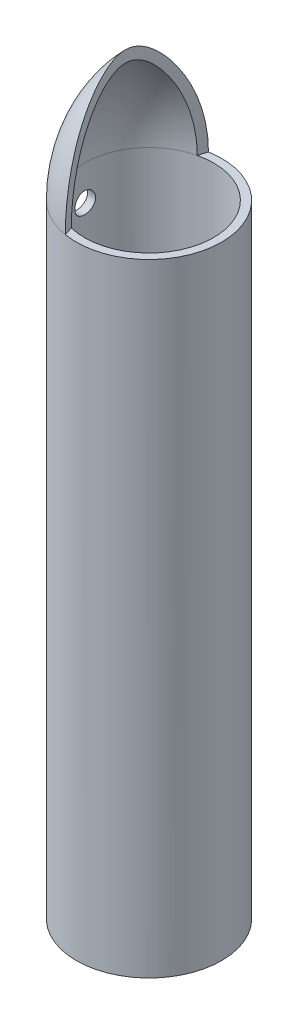
ISO-10303-21;
HEADER;
FILE_DESCRIPTION(('STEP AP214'),'2;1');
FILE_NAME('part.step','',(''),(''),'','','');
FILE_SCHEMA(('AUTOMOTIVE_DESIGN { 1 0 10303 214 1 1 1 1 }'));
ENDSEC;
DATA;
#1=APPLICATION_CONTEXT('core data for automotive mechanical design processes');
#2=APPLICATION_PROTOCOL_DEFINITION('international standard','automotive_design',2000,#1);
#3=PRODUCT_CONTEXT('',#1,'mechanical');
#4=PRODUCT('Part','Part','',(#3));
#5=PRODUCT_RELATED_PRODUCT_CATEGORY('part','',(#4));
#6=PRODUCT_DEFINITION_FORMATION('','',#4);
#7=PRODUCT_DEFINITION_CONTEXT('part definition',#1,'design');
#8=PRODUCT_DEFINITION('design','',#6,#7);
#9=PRODUCT_DEFINITION_SHAPE('','',#8);
#10=(LENGTH_UNIT() NAMED_UNIT(*) SI_UNIT(.MILLI.,.METRE.));
#11=(NAMED_UNIT(*) PLANE_ANGLE_UNIT() SI_UNIT($,.RADIAN.));
#12=(NAMED_UNIT(*) SI_UNIT($,.STERADIAN.) SOLID_ANGLE_UNIT());
#13=UNCERTAINTY_MEASURE_WITH_UNIT(LENGTH_MEASURE(1.E-05),#10,'distance_accuracy_value','');
#14=(GEOMETRIC_REPRESENTATION_CONTEXT(3) GLOBAL_UNCERTAINTY_ASSIGNED_CONTEXT((#13)) GLOBAL_UNIT_ASSIGNED_CONTEXT((#10,
#11,#12)) REPRESENTATION_CONTEXT('',''));
#15=CARTESIAN_POINT('',(0.,0.,0.));
#16=DIRECTION('',(0.,0.,1.));
#17=DIRECTION('',(1.,0.,0.));
#18=AXIS2_PLACEMENT_3D('',#15,#16,#17);
#19=CARTESIAN_POINT('',(0.,45.,0.));
#20=DIRECTION('',(0.,1.,0.));
#21=DIRECTION('',(-1.,0.,0.));
#22=AXIS2_PLACEMENT_3D('',#19,#20,#21);
#23=DEGENERATE_TOROIDAL_SURFACE('',#22,13.7976190476191,23.147619047619,.F.);
#24=CARTESIAN_POINT('',(-2.13614453808668,44.9998,9.10271313929233));
#25=CARTESIAN_POINT('',(-2.13613900706861,45.2821965690539,9.10271416153256));
#26=CARTESIAN_POINT('',(-2.1377680194916,45.5645595018727,9.09702853591646));
#27=CARTESIAN_POINT('',(-2.14424934291709,46.1287888092292,9.07428570337551));
#28=CARTESIAN_POINT('',(-2.14910164089586,46.4106551857687,9.05722854239747));
#29=CARTESIAN_POINT('',(-2.16842411980193,47.2548392089933,8.98900466527923));
#30=CARTESIAN_POINT('',(-2.18765989481923,47.8157717184053,8.92078555464147));
#31=CARTESIAN_POINT('',(-2.23813641105912,48.9359508862094,8.73806397281233));
#32=CARTESIAN_POINT('',(-2.26951029548549,49.4951069393821,8.62304742979431));
#33=CARTESIAN_POINT('',(-2.34256583719652,50.6012175361908,8.34704667598816));
#34=CARTESIAN_POINT('',(-2.38424600909817,51.1481738257317,8.1860690887714));
#35=CARTESIAN_POINT('',(-2.47558293734961,52.2249588008641,7.81876824717853));
#36=CARTESIAN_POINT('',(-2.52522682018881,52.7548134985179,7.61251798214274));
#37=CARTESIAN_POINT('',(-2.62982740296951,53.7944040668025,7.15455225756794));
#38=CARTESIAN_POINT('',(-2.68478649621441,54.3041307274464,6.90281627225695));
#39=CARTESIAN_POINT('',(-2.76860464715438,55.0479929677243,6.49193690762323));
#40=CARTESIAN_POINT('',(-2.79668778316789,55.2917927879285,6.3499059326405));
#41=CARTESIAN_POINT('',(-2.85293965133502,55.7723726778245,6.05446608453946));
#42=CARTESIAN_POINT('',(-2.88110836981176,56.0091538101718,5.90105894625811));
#43=CARTESIAN_POINT('',(-2.93706128548489,56.4746230143158,5.5828042063363));
#44=CARTESIAN_POINT('',(-2.96484581532144,56.7033183940086,5.41796735577597));
#45=CARTESIAN_POINT('',(-3.01958289263859,57.1517063177081,5.07641193980035));
#46=CARTESIAN_POINT('',(-3.04653567491068,57.3714014082223,4.89969677308436));
#47=CARTESIAN_POINT('',(-3.08896204670414,57.7174860573523,4.60445755312306));
#48=CARTESIAN_POINT('',(-3.10484938346105,57.8471467016493,4.48981302481106));
#49=CARTESIAN_POINT('',(-3.13600135519165,58.1020414107379,4.25563974567015));
#50=CARTESIAN_POINT('',(-3.15126606960035,58.2272760399326,4.13611162181653));
#51=CARTESIAN_POINT('',(-3.18106941530525,58.4729374440338,3.89171527266803));
#52=CARTESIAN_POINT('',(-3.19560681109241,58.5933559725063,3.76683858765478));
#53=CARTESIAN_POINT('',(-3.22378797398532,58.8283747940711,3.51160844255946));
#54=CARTESIAN_POINT('',(-3.23743173557925,58.9429750512761,3.38125494870524));
#55=CARTESIAN_POINT('',(-3.26378045504226,59.166225457796,3.1135422519171));
#56=CARTESIAN_POINT('',(-3.27647650317916,59.2748171281353,2.97613314745683));
#57=CARTESIAN_POINT('',(-3.30062105464704,59.4835062021499,2.69480842756386));
#58=CARTESIAN_POINT('',(-3.31206922612266,59.5836013447341,2.55089109568613));
#59=CARTESIAN_POINT('',(-3.33347438961765,59.7729520356253,2.25633887003323));
#60=CARTESIAN_POINT('',(-3.34343448822806,59.8622300904922,2.10571884777));
#61=CARTESIAN_POINT('',(-3.36162135613036,60.0272083535819,1.79722627259027));
#62=CARTESIAN_POINT('',(-3.36984948700549,60.1029192206095,1.63935953649915));
#63=CARTESIAN_POINT('',(-3.38572566803141,60.2505915778272,1.28334026693087));
#64=CARTESIAN_POINT('',(-3.39292075557338,60.3187059861981,1.08349187137986));
#65=CARTESIAN_POINT('',(-3.40103622399927,60.3961516802414,0.777697736095826));
#66=CARTESIAN_POINT('',(-3.40329437517437,60.4178377050016,0.674855658231422));
#67=CARTESIAN_POINT('',(-3.40686411027458,60.4522138357808,0.467633569866373));
#68=CARTESIAN_POINT('',(-3.40817573096498,60.4649042912069,0.36325361926075));
#69=CARTESIAN_POINT('',(-3.40981466634882,60.4807727929041,0.153031393466158));
#70=CARTESIAN_POINT('',(-3.41013509476996,60.4838842889943,0.047183997173146));
#71=CARTESIAN_POINT('',(-3.4097614308888,60.4802614938235,-0.164336999422585));
#72=CARTESIAN_POINT('',(-3.40906735335381,60.4735273458773,-0.270010602232653));
#73=CARTESIAN_POINT('',(-3.40668652527223,60.4505115541526,-0.480447618549057));
#74=CARTESIAN_POINT('',(-3.40499830956046,60.4342158185923,-0.585209456557172));
#75=CARTESIAN_POINT('',(-3.40068099288975,60.3927674949846,-0.792938664554876));
#76=CARTESIAN_POINT('',(-3.39805173216665,60.3676134030381,-0.895905726724982));
#77=CARTESIAN_POINT('',(-3.39094865238457,60.3001184669914,-1.13186921888082));
#78=CARTESIAN_POINT('',(-3.38615423035561,60.2548565075804,-1.26401992395431));
#79=CARTESIAN_POINT('',(-3.37522613468922,60.1527905100764,-1.5237878477227));
#80=CARTESIAN_POINT('',(-3.3690912315636,60.0959758792238,-1.65140077860655));
#81=CARTESIAN_POINT('',(-3.35563435601662,59.9727349720447,-1.90220597574156));
#82=CARTESIAN_POINT('',(-3.34830930681165,59.9062838324434,-2.02538574519004));
#83=CARTESIAN_POINT('',(-3.33263312246021,59.7656120782808,-2.26707965105329));
#84=CARTESIAN_POINT('',(-3.32428224010905,59.6913933785384,-2.38559492746827));
#85=CARTESIAN_POINT('',(-3.30700406567491,59.5393770447899,-2.6139440649598));
#86=CARTESIAN_POINT('',(-3.29810949186248,59.4618131234955,-2.72393689391352));
#87=CARTESIAN_POINT('',(-3.27957892810212,59.3016176477977,-2.94011581358696));
#88=CARTESIAN_POINT('',(-3.26994278968613,59.2189850792801,-3.04630113573783));
#89=CARTESIAN_POINT('',(-3.24003919168833,58.9644990692071,-3.35961439622402));
#90=CARTESIAN_POINT('',(-3.21878558848017,58.7861368690812,-3.56138308579093));
#91=CARTESIAN_POINT('',(-3.17421250306651,58.41591312972,-3.952284626907));
#92=CARTESIAN_POINT('',(-3.15089001062699,58.2240320067648,-4.14139834017225));
#93=CARTESIAN_POINT('',(-3.1026947649947,57.829387870911,-4.50779174924846));
#94=CARTESIAN_POINT('',(-3.07782151829179,57.6266213967531,-4.68506764024971));
#95=CARTESIAN_POINT('',(-3.02956415470171,57.2329670085325,-5.01099633083352));
#96=CARTESIAN_POINT('',(-3.00628444577561,57.0429566485893,-5.16072946797942));
#97=CARTESIAN_POINT('',(-2.95915492675574,56.6564223596774,-5.45146388501347));
#98=CARTESIAN_POINT('',(-2.93530504046949,56.4598975588159,-5.59246398876911));
#99=CARTESIAN_POINT('',(-2.86332368551926,55.8614192480048,-6.00283289430781));
#100=CARTESIAN_POINT('',(-2.81477745306443,55.4506974901808,-6.25945921662686));
#101=CARTESIAN_POINT('',(-2.71881372750756,54.6101157315768,-6.73955682771491));
#102=CARTESIAN_POINT('',(-2.67139669302746,54.1802481515452,-6.963014831731));
#103=CARTESIAN_POINT('',(-2.57973856350241,53.3047127297051,-7.37689043290025));
#104=CARTESIAN_POINT('',(-2.53549666140532,52.8590489462925,-7.56731644365668));
#105=CARTESIAN_POINT('',(-2.45036305478668,51.9369818477586,-7.9219167996565));
#106=CARTESIAN_POINT('',(-2.40966859902115,51.4600571354648,-8.0847819288578));
#107=CARTESIAN_POINT('',(-2.33538972968402,50.4948148828323,-8.37471017587687));
#108=CARTESIAN_POINT('',(-2.30180665782957,50.0064952118474,-8.50176653908647));
#109=CARTESIAN_POINT('',(-2.24322372558948,49.0222008561289,-8.71962954889306));
#110=CARTESIAN_POINT('',(-2.21820968883876,48.5262402470837,-8.81049610776549));
#111=CARTESIAN_POINT('',(-2.17773772505174,47.5288305623983,-8.95605403753089));
#112=CARTESIAN_POINT('',(-2.16227551388157,47.027384050122,-9.01076162702301));
#113=CARTESIAN_POINT('',(-2.14666118559858,46.2708081823322,-9.06581046148944));
#114=CARTESIAN_POINT('',(-2.14271920032543,46.0166680226637,-9.07965835828429));
#115=CARTESIAN_POINT('',(-2.13746032738563,45.5082930596267,-9.09810551687579));
#116=CARTESIAN_POINT('',(-2.13614068056981,45.2540586375406,-9.10271449963709));
#117=CARTESIAN_POINT('',(-2.13614453808668,44.9998,-9.10271313929233));
#118=B_SPLINE_CURVE_WITH_KNOTS('',3,(#24,#25,#26,#27,#28,#29,#30,#31,#32,#33,#34,#35,#36,#37,
#38,#39,#40,#41,#42,#43,#44,#45,#46,#47,#48,#49,#50,#51,#52,#53,#54,#55,#56,#57,#58,#59,#60,#61,
#62,#63,#64,#65,#66,#67,#68,#69,#70,#71,#72,#73,#74,#75,#76,#77,#78,#79,#80,#81,#82,#83,#84,#85,
#86,#87,#88,#89,#90,#91,#92,#93,#94,#95,#96,#97,#98,#99,#100,#101,#102,#103,#104,#105,#106,#107,
#108,#109,#110,#111,#112,#113,#114,#115,#116,#117),.UNSPECIFIED.,.F.,.F.,(4,2,2,2,2,2,2,2,2,2,2,
2,2,2,2,2,2,2,2,2,2,2,2,2,2,2,2,2,2,2,2,2,2,2,2,2,2,2,2,2,2,2,2,2,2,2,4),(0.,0.847060428316519,
1.69411743409592,3.38814182374842,5.10130038775966,6.81421218832933,8.52438242725574,
10.2353263294596,11.0857185384917,11.9359813304322,12.7854549176353,13.6346864742605,
14.1559904889914,14.6772277856692,15.1993223804674,15.7214201951779,16.2479309159792,
16.7745813150886,17.3001164042382,17.8252367890501,18.4564376313996,18.7714855418716,
19.0865212145426,19.4037407259086,19.7209556198253,20.0386392006652,20.3563767412439,
20.7749988787312,21.1940066000214,21.6141153050665,22.034120689933,22.4386003838498,
22.8431612700654,23.65270575266,24.4634480729181,25.2744497329876,26.0032934380032,
26.7322350884952,28.1906450562999,29.6496375871639,31.1082579495387,32.6236140873058,
34.1392558757067,35.6523779818284,37.1648209368186,37.9283068912499,38.69098910145),.UNSPECIFIED.);
#119=CARTESIAN_POINT('',(-2.13614453781513,45.,9.10271314024354));
#120=VERTEX_POINT('',#119);
#121=CARTESIAN_POINT('',(-2.13614453781513,45.,-9.10271314024355));
#122=VERTEX_POINT('',#121);
#123=EDGE_CURVE('E75',#120,#122,#118,.T.);
#124=ORIENTED_EDGE('',*,*,#123,.F.);
#125=CARTESIAN_POINT('',(0.,45.,0.));
#126=DIRECTION('',(0.,1.,0.));
#127=DIRECTION('',(-1.,0.,0.));
#128=AXIS2_PLACEMENT_3D('',#125,#126,#127);
#129=CIRCLE('',#128,9.35);
#130=EDGE_CURVE('E105',#122,#120,#129,.T.);
#131=ORIENTED_EDGE('',*,*,#130,.F.);
#132=EDGE_LOOP('',(#124,#131));
#133=FACE_BOUND('',#132,.T.);
#134=ADVANCED_FACE('F32',(#133),#23,.T.);
#135=CARTESIAN_POINT('',(0.,45.,0.));
#136=DIRECTION('',(0.,1.,0.));
#137=DIRECTION('',(-1.,0.,0.));
#138=AXIS2_PLACEMENT_3D('',#135,#136,#137);
#139=DEGENERATE_TOROIDAL_SURFACE('',#138,13.7976190476191,24.2976190476191,.F.);
#140=CARTESIAN_POINT('',(-1.75248907592077,44.9998,-10.3527185811985));
#141=CARTESIAN_POINT('',(-1.7524796173234,45.3011955377242,-10.3527228563951));
#142=CARTESIAN_POINT('',(-1.75446639570545,45.6025881367124,-10.346701121264));
#143=CARTESIAN_POINT('',(-1.76236950565274,46.2048382284385,-10.3226189687445));
#144=CARTESIAN_POINT('',(-1.76828580831068,46.5056957250964,-10.3045586399173));
#145=CARTESIAN_POINT('',(-1.78398533078986,47.1063616625421,-10.2564117700447));
#146=CARTESIAN_POINT('',(-1.79376869003794,47.4061700651116,-10.2263247953778));
#147=CARTESIAN_POINT('',(-1.8170726881724,48.004173548466,-10.1541585289913));
#148=CARTESIAN_POINT('',(-1.83059333316413,48.3023686266145,-10.1120792176807));
#149=CARTESIAN_POINT('',(-1.87674697016768,49.1980743722111,-9.96719864992255));
#150=CARTESIAN_POINT('',(-1.91485731680298,49.7924626150306,-9.84609317152977));
#151=CARTESIAN_POINT('',(-2.00367235183664,50.9682692198187,-9.55577515819008));
#152=CARTESIAN_POINT('',(-2.05437599110145,51.5496886578094,-9.38656663048638));
#153=CARTESIAN_POINT('',(-2.16579911105466,52.6958447256559,-9.00043108404154));
#154=CARTESIAN_POINT('',(-2.22652364107263,53.2605727750332,-8.78347999028599));
#155=CARTESIAN_POINT('',(-2.35480223913366,54.3689298730929,-8.30236425074223));
#156=CARTESIAN_POINT('',(-2.4223583244702,54.9125526236138,-8.03818564133031));
#157=CARTESIAN_POINT('',(-2.56030085032126,55.9715046614859,-7.46436471349719));
#158=CARTESIAN_POINT('',(-2.63067142869111,56.4869619655017,-7.15495661261045));
#159=CARTESIAN_POINT('',(-2.73554095076866,57.2366772484288,-6.65612472275833));
#160=CARTESIAN_POINT('',(-2.77037390204521,57.4826083270366,-6.48411112094122));
#161=CARTESIAN_POINT('',(-2.83930062311231,57.9659298585559,-6.12829084016446));
#162=CARTESIAN_POINT('',(-2.87339442638726,58.2033206986742,-5.94448469692245));
#163=CARTESIAN_POINT('',(-2.93176397777483,58.6091571343956,-5.61324462516839));
#164=CARTESIAN_POINT('',(-2.95632678427183,58.7797502089761,-5.46848471530864));
#165=CARTESIAN_POINT('',(-3.0045000500707,59.1149933905446,-5.1721238276797));
#166=CARTESIAN_POINT('',(-3.02811066449742,59.2796444651007,-5.02052397282526));
#167=CARTESIAN_POINT('',(-3.07419755538304,59.602696739214,-4.70981807662253));
#168=CARTESIAN_POINT('',(-3.09667081718139,59.7610811085085,-4.55069404910179));
#169=CARTESIAN_POINT('',(-3.14015928517548,60.0701505151181,-4.22492946699771));
#170=CARTESIAN_POINT('',(-3.16117453501711,60.2208357828719,-4.05828913766302));
#171=CARTESIAN_POINT('',(-3.20166720999833,60.5145493404208,-3.71528663886193));
#172=CARTESIAN_POINT('',(-3.22112740140604,60.6574873321145,-3.53884472153647));
#173=CARTESIAN_POINT('',(-3.25796360076284,60.9320461039075,-3.17695385794839));
#174=CARTESIAN_POINT('',(-3.2753386381342,61.0636616057126,-2.99150077324309));
#175=CARTESIAN_POINT('',(-3.30755931549245,61.3119134977339,-2.61144472892631));
#176=CARTESIAN_POINT('',(-3.3224134155855,61.4285996517982,-2.41687528631685));
#177=CARTESIAN_POINT('',(-3.34918835422003,61.6427206541593,-2.0172559068572));
#178=CARTESIAN_POINT('',(-3.36111289136194,61.7401797458442,-1.81221958388473));
#179=CARTESIAN_POINT('',(-3.37659038355075,61.868704870511,-1.4922035950863));
#180=CARTESIAN_POINT('',(-3.38141915440953,61.9092280277103,-1.38106752532351));
#181=CARTESIAN_POINT('',(-3.39003251776655,61.9820581165554,-1.15607521105834));
#182=CARTESIAN_POINT('',(-3.39381723994818,62.0143660685892,-1.04221930630286));
#183=CARTESIAN_POINT('',(-3.40024189625707,62.0695258948414,-0.812537655484496));
#184=CARTESIAN_POINT('',(-3.40288515843263,62.0924052501002,-0.696718673326213));
#185=CARTESIAN_POINT('',(-3.40696590345268,62.1278435288614,-0.463476203187788));
#186=CARTESIAN_POINT('',(-3.40840345281943,62.1404030217363,-0.346052804090766));
#187=CARTESIAN_POINT('',(-3.41003041226679,62.1546234593529,-0.109721575830864));
#188=CARTESIAN_POINT('',(-3.41021120879544,62.1562091916373,0.00919091223585931));
#189=CARTESIAN_POINT('',(-3.40929540133334,62.1481979080965,0.246627361426437));
#190=CARTESIAN_POINT('',(-3.40819879579514,62.1386008787245,0.365151322079454));
#191=CARTESIAN_POINT('',(-3.40476250008301,62.1086899545979,0.601059964426326));
#192=CARTESIAN_POINT('',(-3.40242016760845,62.0883532807234,0.718441682381091));
#193=CARTESIAN_POINT('',(-3.39656342971779,62.0378929634285,0.951041460993592));
#194=CARTESIAN_POINT('',(-3.3930488063891,62.007767500435,1.06625911517265));
#195=CARTESIAN_POINT('',(-3.38340627239088,61.9258872370802,1.33701944583885));
#196=CARTESIAN_POINT('',(-3.37679269545918,61.8702602585257,1.49137272561075));
#197=CARTESIAN_POINT('',(-3.36175690487655,61.7456890002892,1.7944980693225));
#198=CARTESIAN_POINT('',(-3.35333376809351,61.6767379252399,1.94326723889962));
#199=CARTESIAN_POINT('',(-3.33487896531339,61.5279532248748,2.23559568041694));
#200=CARTESIAN_POINT('',(-3.32484314429105,61.4480915706832,2.37914028696271));
#201=CARTESIAN_POINT('',(-3.30336527977235,61.2796389897384,2.66094410066153));
#202=CARTESIAN_POINT('',(-3.2919226292851,61.1910442983185,2.79920099240808));
#203=CARTESIAN_POINT('',(-3.26775950651569,61.0064107209077,3.07113087900582));
#204=CARTESIAN_POINT('',(-3.25503522611458,60.9103498559392,3.20478852948929));
#205=CARTESIAN_POINT('',(-3.22848151732684,60.7121906899895,3.46738639105079));
#206=CARTESIAN_POINT('',(-3.2146522476241,60.6100932564458,3.59632727562491));
#207=CARTESIAN_POINT('',(-3.18600022083241,60.4006202246723,3.84990695668578));
#208=CARTESIAN_POINT('',(-3.1711766336958,60.2932402370554,3.97454202385963));
#209=CARTESIAN_POINT('',(-3.1406601649837,60.0739232324425,4.21963500522032));
#210=CARTESIAN_POINT('',(-3.12496718226658,59.9619856856435,4.34009243073706));
#211=CARTESIAN_POINT('',(-3.07670586245069,59.6198319230305,4.69577872277796));
#212=CARTESIAN_POINT('',(-3.04298945597676,59.3835241965788,4.92502349744468));
#213=CARTESIAN_POINT('',(-2.97332109391029,58.897697771065,5.36844297174646));
#214=CARTESIAN_POINT('',(-2.93736972292429,58.6481825292486,5.5826215813007));
#215=CARTESIAN_POINT('',(-2.8699368229131,58.179231252392,5.96290942399382));
#216=CARTESIAN_POINT('',(-2.83867926198745,57.9615030131237,6.13117135948247));
#217=CARTESIAN_POINT('',(-2.77552963856311,57.5188258702432,6.45779997479187));
#218=CARTESIAN_POINT('',(-2.74363750770934,57.2938761871278,6.6161655809011));
#219=CARTESIAN_POINT('',(-2.64759443887287,56.6090068719032,7.07672104348088));
#220=CARTESIAN_POINT('',(-2.58309464275292,56.1391884540877,7.3642718227392));
#221=CARTESIAN_POINT('',(-2.45627343488483,55.1775211457292,7.90047082576895));
#222=CARTESIAN_POINT('',(-2.39395271314262,54.6856653875272,8.14910681223665));
#223=CARTESIAN_POINT('',(-2.27434033363613,53.6835658689624,8.60716268514992));
#224=CARTESIAN_POINT('',(-2.21704755676451,53.1733262362819,8.81659131009206));
#225=CARTESIAN_POINT('',(-2.10876966226258,52.1257301135289,9.20027517592682));
#226=CARTESIAN_POINT('',(-2.05795922049328,51.5880201445545,9.37361418987647));
#227=CARTESIAN_POINT('',(-1.96650595972229,50.4999266965836,9.67854378700521));
#228=CARTESIAN_POINT('',(-1.92586514879477,49.9495407380053,9.81012612637164));
#229=CARTESIAN_POINT('',(-1.8566429726435,48.8407212281784,10.030906253559));
#230=CARTESIAN_POINT('',(-1.82803843745584,48.2823052987644,10.1201855174442));
#231=CARTESIAN_POINT('',(-1.78405383654154,47.1600428908244,10.256423836557));
#232=CARTESIAN_POINT('',(-1.76866639609774,46.5961996184206,10.3034064926468));
#233=CARTESIAN_POINT('',(-1.75763801159635,45.859561824457,10.3370382711453));
#234=CARTESIAN_POINT('',(-1.75570680568402,45.6875850453319,10.3429222685874));
#235=CARTESIAN_POINT('',(-1.75313281548559,45.3436773352552,10.3507610567426));
#236=CARTESIAN_POINT('',(-1.75248894671964,45.1717464878141,10.35271915472));
#237=CARTESIAN_POINT('',(-1.75248907592077,44.9998,10.3527185811985));
#238=B_SPLINE_CURVE_WITH_KNOTS('',3,(#140,#141,#142,#143,#144,#145,#146,#147,#148,#149,#150,
#151,#152,#153,#154,#155,#156,#157,#158,#159,#160,#161,#162,#163,#164,#165,#166,#167,#168,#169,
#170,#171,#172,#173,#174,#175,#176,#177,#178,#179,#180,#181,#182,#183,#184,#185,#186,#187,#188,
#189,#190,#191,#192,#193,#194,#195,#196,#197,#198,#199,#200,#201,#202,#203,#204,#205,#206,#207,
#208,#209,#210,#211,#212,#213,#214,#215,#216,#217,#218,#219,#220,#221,#222,#223,#224,#225,#226,
#227,#228,#229,#230,#231,#232,#233,#234,#235,#236,#237),.UNSPECIFIED.,.F.,.F.,(4,2,2,2,2,2,2,2,
2,2,2,2,2,2,2,2,2,2,2,2,2,2,2,2,2,2,2,2,2,2,2,2,2,2,2,2,2,2,2,2,2,2,2,2,2,2,2,2,4),(0.,
0.904114101224443,1.80822155146337,2.71236160229479,3.61650313016515,5.43751948736328,
7.25838418851872,9.08016920485539,10.9024937566739,12.715695528992,13.6218149712412,
14.5278932789362,15.2029699724122,15.8779362388711,16.5546067546371,17.2312570053871,
17.9145886221855,18.598237086062,19.2795438440137,19.9599859738069,20.3148998252044,
20.669769572167,21.0235975558282,21.3774060166086,21.7336370452012,22.0898685053344,
22.446858596247,22.8039150836753,23.2957057175871,23.7877478327441,24.2810786259873,
24.7746230237612,25.2696797632176,25.7646655365335,26.2600697898135,26.7555317977569,
27.7476240795257,28.7394579397524,29.5699846344375,30.400601282005,32.062303772258,
33.7245277628555,35.3863808364623,37.0863248665663,38.7866042996789,40.4835955342188,
42.1796392855738,42.6958701277595,43.2116659026959),.UNSPECIFIED.);
#239=CARTESIAN_POINT('',(-1.75248907563025,45.,-10.3527185820825));
#240=VERTEX_POINT('',#239);
#241=CARTESIAN_POINT('',(-1.75248907563025,45.,10.3527185820825));
#242=VERTEX_POINT('',#241);
#243=EDGE_CURVE('E11',#240,#242,#238,.T.);
#244=ORIENTED_EDGE('',*,*,#243,.F.);
#245=CARTESIAN_POINT('',(0.,45.,0.));
#246=DIRECTION('',(0.,1.,0.));
#247=DIRECTION('',(0.,0.,1.));
#248=AXIS2_PLACEMENT_3D('',#245,#246,#247);
#249=CIRCLE('',#248,10.5);
#250=EDGE_CURVE('E47',#240,#242,#249,.T.);
#251=ORIENTED_EDGE('',*,*,#250,.T.);
#252=EDGE_LOOP('',(#244,#251));
#253=FACE_BOUND('',#252,.T.);
#254=ADVANCED_FACE('F79',(#253),#139,.F.);
#255=CARTESIAN_POINT('',(0.,-45.,0.));
#256=DIRECTION('',(0.,1.,0.));
#257=DIRECTION('',(0.,0.,1.));
#258=AXIS2_PLACEMENT_3D('',#255,#256,#257);
#259=PLANE('',#258);
#260=CARTESIAN_POINT('',(0.,-45.,0.));
#261=DIRECTION('',(0.,1.,0.));
#262=DIRECTION('',(0.,0.,1.));
#263=AXIS2_PLACEMENT_3D('',#260,#261,#262);
#264=CIRCLE('',#263,10.5);
#265=CARTESIAN_POINT('',(0.,-45.,10.5));
#266=VERTEX_POINT('',#265);
#267=EDGE_CURVE('E69',#266,#266,#264,.T.);
#268=ORIENTED_EDGE('',*,*,#267,.F.);
#269=EDGE_LOOP('',(#268));
#270=FACE_BOUND('',#269,.T.);
#271=CARTESIAN_POINT('',(0.,-45.,0.));
#272=DIRECTION('',(0.,1.,0.));
#273=DIRECTION('',(0.,0.,1.));
#274=AXIS2_PLACEMENT_3D('',#271,#272,#273);
#275=CIRCLE('',#274,9.35);
#276=CARTESIAN_POINT('',(0.,-45.,9.35));
#277=VERTEX_POINT('',#276);
#278=EDGE_CURVE('E83',#277,#277,#275,.T.);
#279=ORIENTED_EDGE('',*,*,#278,.T.);
#280=EDGE_LOOP('',(#279));
#281=FACE_BOUND('',#280,.T.);
#282=ADVANCED_FACE('F118',(#270,#281),#259,.F.);
#283=CARTESIAN_POINT('',(0.,45.,0.));
#284=DIRECTION('',(0.,-1.,0.));
#285=DIRECTION('',(0.,0.,-1.));
#286=AXIS2_PLACEMENT_3D('',#283,#284,#285);
#287=CYLINDRICAL_SURFACE('',#286,10.5);
#288=CARTESIAN_POINT('',(-10.5,38.5,0.));
#289=CARTESIAN_POINT('',(-10.4999987028432,38.5000034898832,-0.0837980470596159));
#290=CARTESIAN_POINT('',(-10.4989863030044,38.5070458107391,-0.167645858243275));
#291=CARTESIAN_POINT('',(-10.4950450575882,38.535023704351,-0.333000990552121));
#292=CARTESIAN_POINT('',(-10.4921143049446,38.5559731026556,-0.414505898300219));
#293=CARTESIAN_POINT('',(-10.4846659524273,38.6111290926013,-0.572758015178164));
#294=CARTESIAN_POINT('',(-10.4801495125244,38.6453259952398,-0.649508654024656));
#295=CARTESIAN_POINT('',(-10.4700298362088,38.725983314343,-0.796169475360476));
#296=CARTESIAN_POINT('',(-10.4644267614753,38.7724419067744,-0.866080673157976));
#297=CARTESIAN_POINT('',(-10.4527130868134,38.8766562567509,-0.997587975595969));
#298=CARTESIAN_POINT('',(-10.4465994865122,38.9344819642869,-1.05912838620097));
#299=CARTESIAN_POINT('',(-10.4345774973183,39.0596386218095,-1.17166693765294));
#300=CARTESIAN_POINT('',(-10.4286691198171,39.1269700983948,-1.22266449406304));
#301=CARTESIAN_POINT('',(-10.4176973473603,39.2695976740806,-1.31288381463334));
#302=CARTESIAN_POINT('',(-10.4126378279944,39.3449278694277,-1.35205218821083));
#303=CARTESIAN_POINT('',(-10.4039772398443,39.5011818092366,-1.41716017750215));
#304=CARTESIAN_POINT('',(-10.4003760990033,39.58210527711,-1.44310044681747));
#305=CARTESIAN_POINT('',(-10.3950692906489,39.746665014742,-1.48084398009175));
#306=CARTESIAN_POINT('',(-10.393350892854,39.8302790798917,-1.49274223279193));
#307=CARTESIAN_POINT('',(-10.3919654076813,39.9983333581522,-1.50235815011353));
#308=CARTESIAN_POINT('',(-10.3922982133056,40.0827735279411,-1.50007655440469));
#309=CARTESIAN_POINT('',(-10.3949658865654,40.2494148179996,-1.48147527146912));
#310=CARTESIAN_POINT('',(-10.3972857165318,40.3316279830688,-1.46526102269474));
#311=CARTESIAN_POINT('',(-10.4036425753426,40.4921546294264,-1.41941958482143));
#312=CARTESIAN_POINT('',(-10.4076796486131,40.5704680097667,-1.38979204871222));
#313=CARTESIAN_POINT('',(-10.4170328660292,40.7212949096626,-1.31785428187431));
#314=CARTESIAN_POINT('',(-10.4223535362188,40.7937866685787,-1.27549903967451));
#315=CARTESIAN_POINT('',(-10.433671108351,40.9306738182839,-1.17934026858057));
#316=CARTESIAN_POINT('',(-10.4396680505927,40.9950687260949,-1.12553605726883));
#317=CARTESIAN_POINT('',(-10.4517290352068,41.1145456046719,-1.00742618807159));
#318=CARTESIAN_POINT('',(-10.457793193268,41.1695379175899,-0.943029806366417));
#319=CARTESIAN_POINT('',(-10.4692547684339,41.2679477518349,-0.805873739101335));
#320=CARTESIAN_POINT('',(-10.4746521830884,41.311365230626,-0.733114022808735));
#321=CARTESIAN_POINT('',(-10.484177029702,41.3853961562489,-0.581221559720765));
#322=CARTESIAN_POINT('',(-10.4883038145903,41.4160030821207,-0.502085591600481));
#323=CARTESIAN_POINT('',(-10.4948168991903,41.4634682039796,-0.339725024065645));
#324=CARTESIAN_POINT('',(-10.4972033055324,41.4803272422864,-0.256500675473461));
#325=CARTESIAN_POINT('',(-10.4999527092955,41.4996997201153,-0.0891000167924588));
#326=CARTESIAN_POINT('',(-10.5003331021836,41.5023364948514,-0.00493825465679301));
#327=CARTESIAN_POINT('',(-10.4990748545078,41.4935163939849,0.162626137734972));
#328=CARTESIAN_POINT('',(-10.4974362704799,41.4820599130262,0.246028789182044));
#329=CARTESIAN_POINT('',(-10.4923349529923,41.445481043804,0.409336813488367));
#330=CARTESIAN_POINT('',(-10.4888801904757,41.4204183556153,0.489255828690094));
#331=CARTESIAN_POINT('',(-10.4805328070432,41.3574011955284,0.643757208018514));
#332=CARTESIAN_POINT('',(-10.4756401241147,41.3194461676156,0.718339341810812));
#333=CARTESIAN_POINT('',(-10.464917828782,41.2314296372594,0.860594771848395));
#334=CARTESIAN_POINT('',(-10.4590822113691,41.1812894277209,0.928218909523479));
#335=CARTESIAN_POINT('',(-10.4471433482308,41.0704359429608,1.05413647110365));
#336=CARTESIAN_POINT('',(-10.4410400884811,41.0097221131865,1.11242940530893));
#337=CARTESIAN_POINT('',(-10.4291991012728,40.8788974742767,1.21847523465575));
#338=CARTESIAN_POINT('',(-10.4234644616138,40.8087195472746,1.26614572563628));
#339=CARTESIAN_POINT('',(-10.4130635361061,40.661280110047,1.34902176565436));
#340=CARTESIAN_POINT('',(-10.4083972235518,40.5840187769563,1.38422762628812));
#341=CARTESIAN_POINT('',(-10.4006832769632,40.4248575216203,1.441045580689));
#342=CARTESIAN_POINT('',(-10.3976303728443,40.342973680869,1.46270197598978));
#343=CARTESIAN_POINT('',(-10.3934745694833,40.1766845792083,1.49194779900115));
#344=CARTESIAN_POINT('',(-10.3923715491215,40.0922794752417,1.49953810044764));
#345=CARTESIAN_POINT('',(-10.3922446330881,39.924164630109,1.50041692780658));
#346=CARTESIAN_POINT('',(-10.3932019074238,39.8404555512585,1.49383498025855));
#347=CARTESIAN_POINT('',(-10.3970469315899,39.6753474069561,1.466832718881));
#348=CARTESIAN_POINT('',(-10.399934679431,39.5939483391242,1.44641241931013));
#349=CARTESIAN_POINT('',(-10.4073089210813,39.4358010511666,1.39235734174347));
#350=CARTESIAN_POINT('',(-10.4117944216327,39.3590499761777,1.35873077221951));
#351=CARTESIAN_POINT('',(-10.4218600929554,39.2122581662849,1.27923048152315));
#352=CARTESIAN_POINT('',(-10.4274402937947,39.1422176157765,1.2333564239388));
#353=CARTESIAN_POINT('',(-10.4391274698967,39.0101756361033,1.13018960597321));
#354=CARTESIAN_POINT('',(-10.4452386169774,38.9482496910983,1.07280069705274));
#355=CARTESIAN_POINT('',(-10.4572636654055,38.8348602194258,0.948436134990864));
#356=CARTESIAN_POINT('',(-10.4631775204,38.7833991371586,0.881458248251207));
#357=CARTESIAN_POINT('',(-10.4741749686942,38.6921743209729,0.739427568400384));
#358=CARTESIAN_POINT('',(-10.4792542883965,38.6524700093816,0.664336288090722));
#359=CARTESIAN_POINT('',(-10.4879681705616,38.5862951919954,0.508515966277526));
#360=CARTESIAN_POINT('',(-10.4916042510231,38.5598107739257,0.427792953899234));
#361=CARTESIAN_POINT('',(-10.4961777225379,38.5269373098155,0.288908522998167));
#362=CARTESIAN_POINT('',(-10.4976038314235,38.5168509722963,0.231610424383929));
#363=CARTESIAN_POINT('',(-10.4995154149334,38.5033811431839,0.116216191024247));
#364=CARTESIAN_POINT('',(-10.5000008996729,38.4999975795111,0.058120064867296));
#365=CARTESIAN_POINT('',(-10.5,38.5,0.));
#366=B_SPLINE_CURVE_WITH_KNOTS('',3,(#288,#289,#290,#291,#292,#293,#294,#295,#296,#297,#298,
#299,#300,#301,#302,#303,#304,#305,#306,#307,#308,#309,#310,#311,#312,#313,#314,#315,#316,#317,
#318,#319,#320,#321,#322,#323,#324,#325,#326,#327,#328,#329,#330,#331,#332,#333,#334,#335,#336,
#337,#338,#339,#340,#341,#342,#343,#344,#345,#346,#347,#348,#349,#350,#351,#352,#353,#354,#355,
#356,#357,#358,#359,#360,#361,#362,#363,#364,#365),.UNSPECIFIED.,.T.,.F.,(4,2,2,2,2,2,2,2,2,2,2,
2,2,2,2,2,2,2,2,2,2,2,2,2,2,2,2,2,2,2,2,2,2,2,2,2,2,2,4),(0.,0.251181790014658,
0.502613663993753,0.753861991045279,1.00507296375776,1.2578811514321,1.51070334962241,
1.76465016063836,2.01858442290987,2.27079088981466,2.52298420087169,2.77328562434791,
3.02359352365118,3.27479726716424,3.52601598791197,3.77951067530022,4.03300629423345,
4.28663079365747,4.54023975258937,4.79164584064564,5.04304488891045,5.29334968302706,
5.54366527353743,5.79564281989972,6.04763358566374,6.30151593543519,6.5553919380977,
6.80843346555638,7.06145927444515,7.31218238885342,7.56290524492411,7.81347250803813,
8.0640466544003,8.31680735632106,8.56962703086835,8.82370353749485,9.07751209384602,
9.25172688086821,9.42593979443109),.UNSPECIFIED.);
#367=CARTESIAN_POINT('',(-10.5,38.5,0.));
#368=VERTEX_POINT('',#367);
#369=EDGE_CURVE('E137',#368,#368,#366,.T.);
#370=ORIENTED_EDGE('',*,*,#369,.T.);
#371=EDGE_LOOP('',(#370));
#372=FACE_BOUND('',#371,.T.);
#373=ORIENTED_EDGE('',*,*,#250,.F.);
#374=EDGE_CURVE('E64',#242,#240,#249,.T.);
#375=ORIENTED_EDGE('',*,*,#374,.F.);
#376=EDGE_LOOP('',(#373,#375));
#377=FACE_BOUND('',#376,.T.);
#378=ORIENTED_EDGE('',*,*,#267,.T.);
#379=EDGE_LOOP('',(#378));
#380=FACE_BOUND('',#379,.T.);
#381=ADVANCED_FACE('F34',(#372,#377,#380),#287,.T.);
#382=CARTESIAN_POINT('',(0.,45.,0.));
#383=DIRECTION('',(0.,-1.,0.));
#384=DIRECTION('',(0.,0.,-1.));
#385=AXIS2_PLACEMENT_3D('',#382,#383,#384);
#386=CYLINDRICAL_SURFACE('',#385,9.35);
#387=CARTESIAN_POINT('',(-9.22889484174568,40.,-1.5));
#388=CARTESIAN_POINT('',(-9.22889631270027,40.083671916119,-1.49999659959163));
#389=CARTESIAN_POINT('',(-9.2300450589387,40.1673906382857,-1.49297531445932));
#390=CARTESIAN_POINT('',(-9.2345121518168,40.3324822977951,-1.4650860552112));
#391=CARTESIAN_POINT('',(-9.23783254378809,40.4138529481309,-1.44420502723101));
#392=CARTESIAN_POINT('',(-9.24625740027082,40.5718351667002,-1.38924145152265));
#393=CARTESIAN_POINT('',(-9.25136042057192,40.6484505284722,-1.35516958804156));
#394=CARTESIAN_POINT('',(-9.26277384157026,40.7948676878304,-1.27481758420194));
#395=CARTESIAN_POINT('',(-9.26908409468817,40.8646703166723,-1.22853893581194));
#396=CARTESIAN_POINT('',(-9.282265444071,40.9961279292222,-1.12463558936608));
#397=CARTESIAN_POINT('',(-9.28914070545903,41.0577116014263,-1.06692118509862));
#398=CARTESIAN_POINT('',(-9.30264033622068,41.1703643170129,-0.941978439503547));
#399=CARTESIAN_POINT('',(-9.30926469112885,41.2214327549144,-0.874749550695317));
#400=CARTESIAN_POINT('',(-9.32156001666683,41.311871299371,-0.732226110146331));
#401=CARTESIAN_POINT('',(-9.32722552489687,41.3511753004837,-0.656889099621002));
#402=CARTESIAN_POINT('',(-9.33691853967532,41.4165446385316,-0.500576381209454));
#403=CARTESIAN_POINT('',(-9.34094614499021,41.4426107737413,-0.419601013664373));
#404=CARTESIAN_POINT('',(-9.34688015558553,41.4805470759437,-0.25504608948342));
#405=CARTESIAN_POINT('',(-9.34880443306237,41.4925369163998,-0.17149477720074));
#406=CARTESIAN_POINT('',(-9.3503763207317,41.5023522072305,-0.00354561034219133));
#407=CARTESIAN_POINT('',(-9.35002407479414,41.5001785526987,0.0808521904013859));
#408=CARTESIAN_POINT('',(-9.34709680287216,41.4818223140761,0.247281029773136));
#409=CARTESIAN_POINT('',(-9.34454221014633,41.4657685053894,0.329326682305204));
#410=CARTESIAN_POINT('',(-9.33752004939285,41.4203101955933,0.489544328155146));
#411=CARTESIAN_POINT('',(-9.33305242650804,41.390905311633,0.567716210318848));
#412=CARTESIAN_POINT('',(-9.32267126367126,41.3194500852714,0.718352898449269));
#413=CARTESIAN_POINT('',(-9.3167516259352,41.2773462373282,0.790791886461442));
#414=CARTESIAN_POINT('',(-9.30412491552469,41.1817274031096,0.927625068491809));
#415=CARTESIAN_POINT('',(-9.29741778371751,41.1282115596639,0.992018657632824));
#416=CARTESIAN_POINT('',(-9.28387378975379,41.0105723901339,1.11169331956491));
#417=CARTESIAN_POINT('',(-9.27703631688092,40.9463365569081,1.1668637873109));
#418=CARTESIAN_POINT('',(-9.26407544863317,40.8094611239316,1.26566051965061));
#419=CARTESIAN_POINT('',(-9.25795205894299,40.7368214572885,1.30928669234553));
#420=CARTESIAN_POINT('',(-9.24711253853551,40.5850770814779,1.38377555323414));
#421=CARTESIAN_POINT('',(-9.24239779425205,40.5059660999207,1.41462567828553));
#422=CARTESIAN_POINT('',(-9.23493291508277,40.34359268485,1.46256911377087));
#423=CARTESIAN_POINT('',(-9.23218262065903,40.2603305890466,1.47966354135397));
#424=CARTESIAN_POINT('',(-9.22898868022676,40.0930059259223,1.49945615734869));
#425=CARTESIAN_POINT('',(-9.22851982747777,40.0089624339718,1.50231167457521));
#426=CARTESIAN_POINT('',(-9.22987480032527,39.8415978858977,1.49396397730215));
#427=CARTESIAN_POINT('',(-9.23169854413486,39.7582768041094,1.48276126432092));
#428=CARTESIAN_POINT('',(-9.23740998307595,39.5952172405679,1.44674898067699));
#429=CARTESIAN_POINT('',(-9.24128562649872,39.5154607582724,1.42201883472204));
#430=CARTESIAN_POINT('',(-9.25065413236496,39.3612244873501,1.35973671936773));
#431=CARTESIAN_POINT('',(-9.2561470851083,39.2867449936435,1.32218403402387));
#432=CARTESIAN_POINT('',(-9.26819017781731,39.1444747406658,1.23494892819064));
#433=CARTESIAN_POINT('',(-9.27474897630672,39.0767467893608,1.1851652917568));
#434=CARTESIAN_POINT('',(-9.28815913707834,38.9505500846182,1.0750210670858));
#435=CARTESIAN_POINT('',(-9.2950105183497,38.892081933321,1.01465979154975));
#436=CARTESIAN_POINT('',(-9.30831323320658,38.7854936860517,0.884378287630903));
#437=CARTESIAN_POINT('',(-9.3147600977058,38.7374782595282,0.814371900362282));
#438=CARTESIAN_POINT('',(-9.32645657740886,38.6538900826983,0.667195132919147));
#439=CARTESIAN_POINT('',(-9.33170622909658,38.6183169532075,0.590024971154481));
#440=CARTESIAN_POINT('',(-9.34039730557271,38.5607877310966,0.431028281378107));
#441=CARTESIAN_POINT('',(-9.34384612031434,38.5387759199234,0.349222334998204));
#442=CARTESIAN_POINT('',(-9.3485780933629,38.50881438915,0.183015409909876));
#443=CARTESIAN_POINT('',(-9.34986141623295,38.5008636010024,0.0986146288881729));
#444=CARTESIAN_POINT('',(-9.35011574549893,38.499278757742,-0.0693740012498503));
#445=CARTESIAN_POINT('',(-9.34911252906151,38.5054851036559,-0.152960348971291));
#446=CARTESIAN_POINT('',(-9.34495887313955,38.5316943499184,-0.317884009262185));
#447=CARTESIAN_POINT('',(-9.34180844358591,38.551697186458,-0.399221332231602));
#448=CARTESIAN_POINT('',(-9.33371291726627,38.6048721198916,-0.557283709736886));
#449=CARTESIAN_POINT('',(-9.32876953847742,38.6380316131216,-0.634013097769339));
#450=CARTESIAN_POINT('',(-9.31762903076429,38.7165611214484,-0.780843926841491));
#451=CARTESIAN_POINT('',(-9.3114318495386,38.761931645945,-0.850945091210846));
#452=CARTESIAN_POINT('',(-9.29838852945705,38.8641655170029,-0.983335723303574));
#453=CARTESIAN_POINT('',(-9.29153618173436,38.9211461235712,-1.04553403878722));
#454=CARTESIAN_POINT('',(-9.27799894112233,39.0447362115279,-1.15954313116282));
#455=CARTESIAN_POINT('',(-9.27131408784275,39.1113479457727,-1.21135147090619));
#456=CARTESIAN_POINT('',(-9.25882191049763,39.2528219099761,-1.30341692032742));
#457=CARTESIAN_POINT('',(-9.25302057342181,39.3277349585183,-1.34359675031505));
#458=CARTESIAN_POINT('',(-9.24302278433334,39.4833075658953,-1.41074167183632));
#459=CARTESIAN_POINT('',(-9.23882470586271,39.5639612019732,-1.43772016359317));
#460=CARTESIAN_POINT('',(-9.23345488018139,39.704123349954,-1.47173516424548));
#461=CARTESIAN_POINT('',(-9.23175420188495,39.7627763523279,-1.48231777966837));
#462=CARTESIAN_POINT('',(-9.22947366829735,39.8809450123206,-1.49645135102916));
#463=CARTESIAN_POINT('',(-9.22889379504237,39.940460656098,-1.50000241966592));
#464=CARTESIAN_POINT('',(-9.22889484174568,40.,-1.5));
#465=B_SPLINE_CURVE_WITH_KNOTS('',3,(#387,#388,#389,#390,#391,#392,#393,#394,#395,#396,#397,
#398,#399,#400,#401,#402,#403,#404,#405,#406,#407,#408,#409,#410,#411,#412,#413,#414,#415,#416,
#417,#418,#419,#420,#421,#422,#423,#424,#425,#426,#427,#428,#429,#430,#431,#432,#433,#434,#435,
#436,#437,#438,#439,#440,#441,#442,#443,#444,#445,#446,#447,#448,#449,#450,#451,#452,#453,#454,
#455,#456,#457,#458,#459,#460,#461,#462,#463,#464),.UNSPECIFIED.,.T.,.F.,(4,2,2,2,2,2,2,2,2,2,2,
2,2,2,2,2,2,2,2,2,2,2,2,2,2,2,2,2,2,2,2,2,2,2,2,2,2,2,4),(0.,0.250798063782374,
0.501832678732874,0.752664385892683,1.00346544945998,1.25631787958044,1.50918486520659,
1.76344715233564,2.01769410502876,2.26976348458851,2.52181693421787,2.77155670807736,
3.02130364383876,3.27211791727182,3.52295103634036,3.77660458922977,4.03026016127698,
4.28416457299126,4.53804836214316,4.78912062027374,5.04018392181702,5.28978871546253,
5.53940744803244,5.79116589489373,6.04294070622912,6.29713123199905,6.55131401052737,
6.80444535514829,7.05755746258749,7.30783025835208,7.55810189660914,7.80813435912814,
8.05817725371158,8.31088328304644,8.56364851979857,8.81805689170985,9.07220648397432,
9.25067247588349,9.42913560738702),.UNSPECIFIED.);
#466=CARTESIAN_POINT('',(-9.22889484174568,40.,-1.5));
#467=VERTEX_POINT('',#466);
#468=EDGE_CURVE('E37',#467,#467,#465,.T.);
#469=ORIENTED_EDGE('',*,*,#468,.F.);
#470=EDGE_LOOP('',(#469));
#471=FACE_BOUND('',#470,.T.);
#472=EDGE_CURVE('E107',#120,#122,#129,.T.);
#473=ORIENTED_EDGE('',*,*,#472,.T.);
#474=ORIENTED_EDGE('',*,*,#130,.T.);
#475=EDGE_LOOP('',(#473,#474));
#476=FACE_BOUND('',#475,.T.);
#477=ORIENTED_EDGE('',*,*,#278,.F.);
#478=EDGE_LOOP('',(#477));
#479=FACE_BOUND('',#478,.T.);
#480=ADVANCED_FACE('F97',(#471,#476,#479),#386,.F.);
#481=CARTESIAN_POINT('',(29.75,65.,0.));
#482=DIRECTION('',(0.,-1.,0.));
#483=DIRECTION('',(0.,0.,-1.));
#484=AXIS2_PLACEMENT_3D('',#481,#482,#483);
#485=CYLINDRICAL_SURFACE('',#484,33.16);
#486=ORIENTED_EDGE('',*,*,#123,.T.);
#487=CARTESIAN_POINT('',(29.75,45.,0.));
#488=DIRECTION('',(0.,1.,0.));
#489=DIRECTION('',(0.,0.,1.));
#490=AXIS2_PLACEMENT_3D('',#487,#488,#489);
#491=CIRCLE('',#490,33.16);
#492=EDGE_CURVE('E54',#240,#122,#491,.T.);
#493=ORIENTED_EDGE('',*,*,#492,.F.);
#494=ORIENTED_EDGE('',*,*,#243,.T.);
#495=EDGE_CURVE('E59',#120,#242,#491,.T.);
#496=ORIENTED_EDGE('',*,*,#495,.F.);
#497=EDGE_LOOP('',(#486,#493,#494,#496));
#498=FACE_BOUND('',#497,.T.);
#499=ADVANCED_FACE('F73',(#498),#485,.F.);
#500=CARTESIAN_POINT('',(29.75,45.,0.));
#501=DIRECTION('',(0.,1.,0.));
#502=DIRECTION('',(0.,0.,1.));
#503=AXIS2_PLACEMENT_3D('',#500,#501,#502);
#504=PLANE('',#503);
#505=ORIENTED_EDGE('',*,*,#472,.F.);
#506=ORIENTED_EDGE('',*,*,#495,.T.);
#507=ORIENTED_EDGE('',*,*,#374,.T.);
#508=ORIENTED_EDGE('',*,*,#492,.T.);
#509=EDGE_LOOP('',(#505,#506,#507,#508));
#510=FACE_BOUND('',#509,.T.);
#511=ADVANCED_FACE('F65',(#510),#504,.T.);
#512=CARTESIAN_POINT('',(-10.5,40.,0.));
#513=DIRECTION('',(1.,0.,0.));
#514=DIRECTION('',(0.,0.,-1.));
#515=AXIS2_PLACEMENT_3D('',#512,#513,#514);
#516=CYLINDRICAL_SURFACE('',#515,1.5);
#517=ORIENTED_EDGE('',*,*,#468,.T.);
#518=EDGE_LOOP('',(#517));
#519=FACE_BOUND('',#518,.T.);
#520=ORIENTED_EDGE('',*,*,#369,.F.);
#521=EDGE_LOOP('',(#520));
#522=FACE_BOUND('',#521,.T.);
#523=ADVANCED_FACE('F143',(#519,#522),#516,.F.);
#524=CLOSED_SHELL('',(#134,#254,#282,#381,#480,#499,#511,#523));
#525=MANIFOLD_SOLID_BREP('B2',#524);
#526=ADVANCED_BREP_SHAPE_REPRESENTATION('',(#18,#525),#14);
#527=SHAPE_DEFINITION_REPRESENTATION(#9,#526);
ENDSEC;
END-ISO-10303-21;
